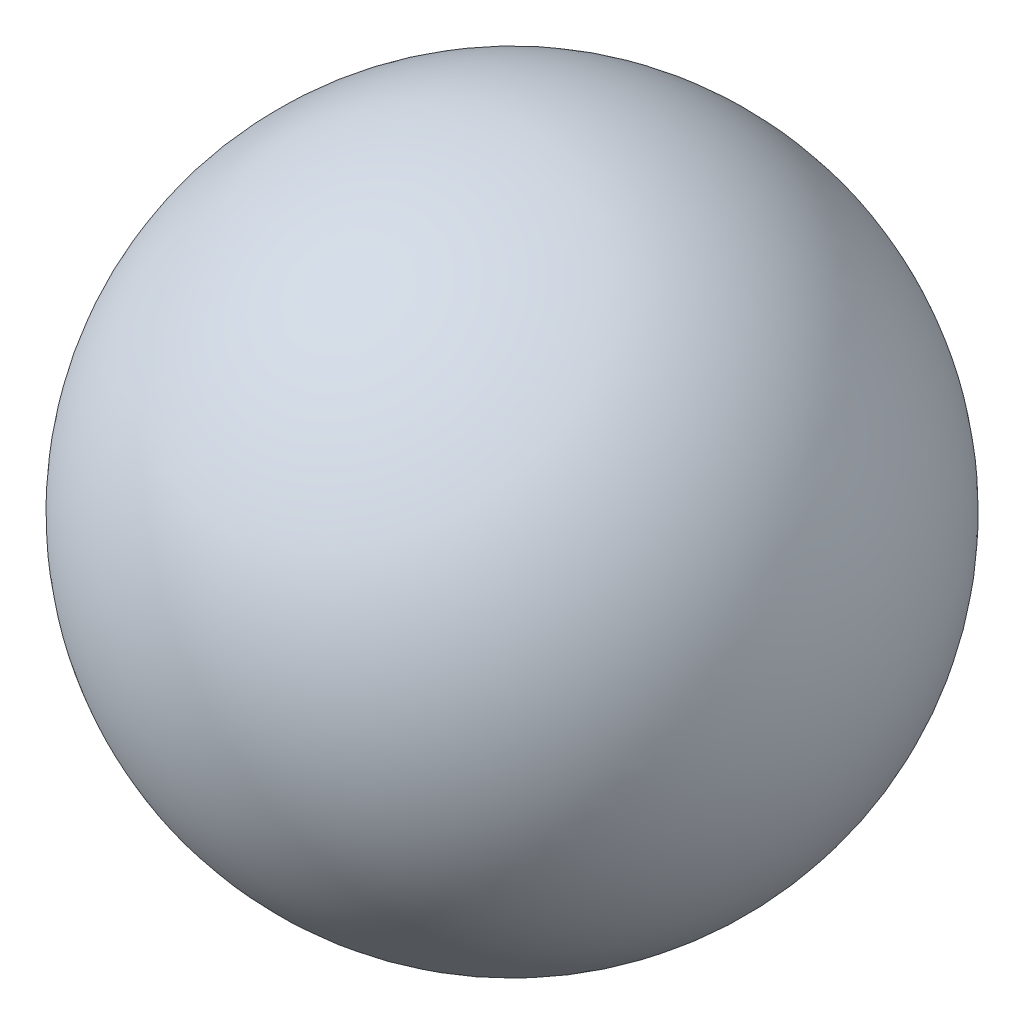
ISO-10303-21;
HEADER;
FILE_DESCRIPTION(('STEP AP214'),'2;1');
FILE_NAME('part.step','',(''),(''),'','','');
FILE_SCHEMA(('AUTOMOTIVE_DESIGN { 1 0 10303 214 1 1 1 1 }'));
ENDSEC;
DATA;
#1=APPLICATION_CONTEXT('core data for automotive mechanical design processes');
#2=APPLICATION_PROTOCOL_DEFINITION('international standard','automotive_design',2000,#1);
#3=PRODUCT_CONTEXT('',#1,'mechanical');
#4=PRODUCT('Part','Part','',(#3));
#5=PRODUCT_RELATED_PRODUCT_CATEGORY('part','',(#4));
#6=PRODUCT_DEFINITION_FORMATION('','',#4);
#7=PRODUCT_DEFINITION_CONTEXT('part definition',#1,'design');
#8=PRODUCT_DEFINITION('design','',#6,#7);
#9=PRODUCT_DEFINITION_SHAPE('','',#8);
#10=(LENGTH_UNIT() NAMED_UNIT(*) SI_UNIT(.MILLI.,.METRE.));
#11=(NAMED_UNIT(*) PLANE_ANGLE_UNIT() SI_UNIT($,.RADIAN.));
#12=(NAMED_UNIT(*) SI_UNIT($,.STERADIAN.) SOLID_ANGLE_UNIT());
#13=UNCERTAINTY_MEASURE_WITH_UNIT(LENGTH_MEASURE(1.E-05),#10,'distance_accuracy_value','');
#14=(GEOMETRIC_REPRESENTATION_CONTEXT(3) GLOBAL_UNCERTAINTY_ASSIGNED_CONTEXT((#13)) GLOBAL_UNIT_ASSIGNED_CONTEXT((#10,
#11,#12)) REPRESENTATION_CONTEXT('',''));
#15=CARTESIAN_POINT('',(0.,0.,0.));
#16=DIRECTION('',(0.,0.,1.));
#17=DIRECTION('',(1.,0.,0.));
#18=AXIS2_PLACEMENT_3D('',#15,#16,#17);
#19=CARTESIAN_POINT('',(0.,0.,-9.52500000000001));
#20=DIRECTION('',(0.,0.,1.));
#21=DIRECTION('',(-1.,0.,0.));
#22=AXIS2_PLACEMENT_3D('',#19,#20,#21);
#23=SPHERICAL_SURFACE('',#22,9.52500000000001);
#24=CARTESIAN_POINT('',(0.,0.,0.));
#25=VERTEX_POINT('',#24);
#26=VERTEX_LOOP('',#25);
#27=FACE_BOUND('',#26,.T.);
#28=ADVANCED_FACE('F26',(#27),#23,.T.);
#29=CLOSED_SHELL('',(#28));
#30=MANIFOLD_SOLID_BREP('B2',#29);
#31=ADVANCED_BREP_SHAPE_REPRESENTATION('',(#18,#30),#14);
#32=SHAPE_DEFINITION_REPRESENTATION(#9,#31);
ENDSEC;
END-ISO-10303-21;
